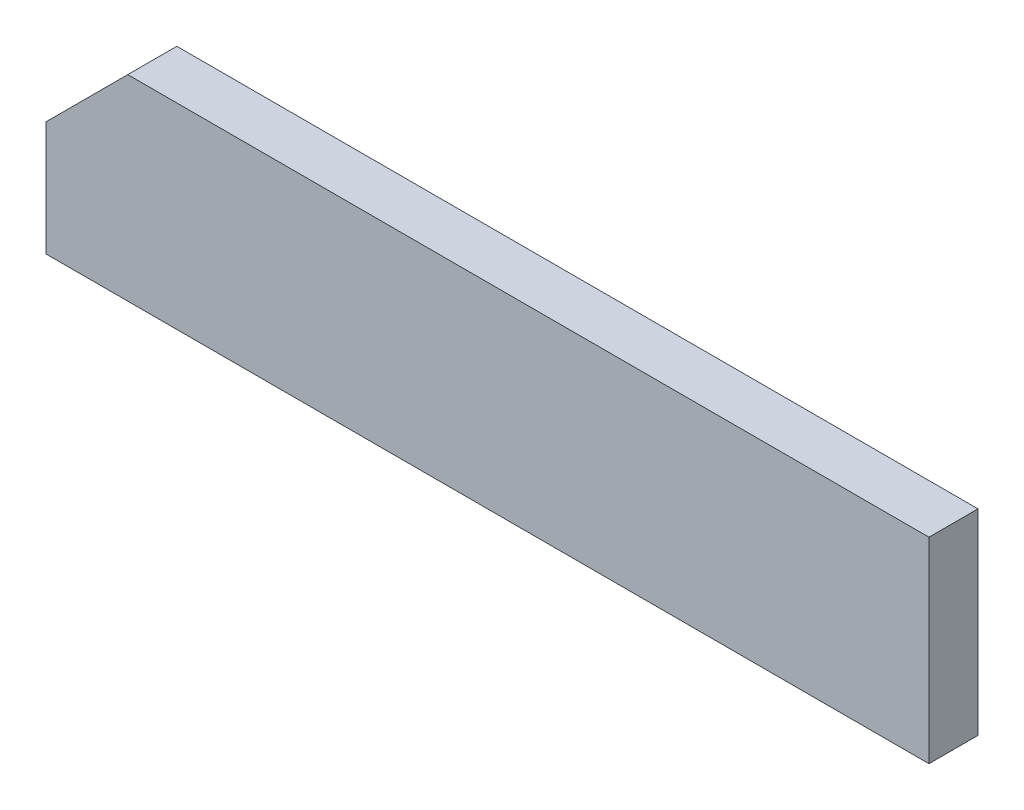
ISO-10303-21;
HEADER;
FILE_DESCRIPTION(('STEP AP214'),'2;1');
FILE_NAME('part.step','',(''),(''),'','','');
FILE_SCHEMA(('AUTOMOTIVE_DESIGN { 1 0 10303 214 1 1 1 1 }'));
ENDSEC;
DATA;
#1=APPLICATION_CONTEXT('core data for automotive mechanical design processes');
#2=APPLICATION_PROTOCOL_DEFINITION('international standard','automotive_design',2000,#1);
#3=PRODUCT_CONTEXT('',#1,'mechanical');
#4=PRODUCT('Part','Part','',(#3));
#5=PRODUCT_RELATED_PRODUCT_CATEGORY('part','',(#4));
#6=PRODUCT_DEFINITION_FORMATION('','',#4);
#7=PRODUCT_DEFINITION_CONTEXT('part definition',#1,'design');
#8=PRODUCT_DEFINITION('design','',#6,#7);
#9=PRODUCT_DEFINITION_SHAPE('','',#8);
#10=(LENGTH_UNIT() NAMED_UNIT(*) SI_UNIT(.MILLI.,.METRE.));
#11=(NAMED_UNIT(*) PLANE_ANGLE_UNIT() SI_UNIT($,.RADIAN.));
#12=(NAMED_UNIT(*) SI_UNIT($,.STERADIAN.) SOLID_ANGLE_UNIT());
#13=UNCERTAINTY_MEASURE_WITH_UNIT(LENGTH_MEASURE(1.E-05),#10,'distance_accuracy_value','');
#14=(GEOMETRIC_REPRESENTATION_CONTEXT(3) GLOBAL_UNCERTAINTY_ASSIGNED_CONTEXT((#13)) GLOBAL_UNIT_ASSIGNED_CONTEXT((#10,
#11,#12)) REPRESENTATION_CONTEXT('',''));
#15=CARTESIAN_POINT('',(0.,0.,0.));
#16=DIRECTION('',(0.,0.,1.));
#17=DIRECTION('',(1.,0.,0.));
#18=AXIS2_PLACEMENT_3D('',#15,#16,#17);
#19=CARTESIAN_POINT('',(0.06528164345011,-0.01762491546688,0.2999994));
#20=DIRECTION('',(0.,0.,1.));
#21=DIRECTION('',(1.,0.,0.));
#22=AXIS2_PLACEMENT_3D('',#19,#20,#21);
#23=PLANE('',#22);
#24=DIRECTION('',(-0.707106781186548,-0.707106781186548,0.));
#25=VECTOR('',#24,1.);
#26=CARTESIAN_POINT('',(-2.20000068,0.5999607,0.2999994));
#27=LINE('',#26,#25);
#28=CARTESIAN_POINT('',(-2.20000068,0.5999607,0.2999994));
#29=VERTEX_POINT('',#28);
#30=CARTESIAN_POINT('',(-2.69999968,0.09996169999999,0.2999994));
#31=VERTEX_POINT('',#30);
#32=EDGE_CURVE('E102',#29,#31,#27,.T.);
#33=ORIENTED_EDGE('',*,*,#32,.T.);
#34=DIRECTION('',(0.,-1.,0.));
#35=VECTOR('',#34,1.);
#36=CARTESIAN_POINT('',(-2.69999968,0.09996169999999,0.2999994));
#37=LINE('',#36,#35);
#38=CARTESIAN_POINT('',(-2.69999968,-0.59995816,0.2999994));
#39=VERTEX_POINT('',#38);
#40=EDGE_CURVE('E75',#31,#39,#37,.T.);
#41=ORIENTED_EDGE('',*,*,#40,.T.);
#42=DIRECTION('',(1.,0.,0.));
#43=VECTOR('',#42,1.);
#44=CARTESIAN_POINT('',(-2.69999968,-0.59995816,0.2999994));
#45=LINE('',#44,#43);
#46=CARTESIAN_POINT('',(2.69999968,-0.59995816,0.2999994));
#47=VERTEX_POINT('',#46);
#48=EDGE_CURVE('E113',#39,#47,#45,.T.);
#49=ORIENTED_EDGE('',*,*,#48,.T.);
#50=DIRECTION('',(0.,1.,0.));
#51=VECTOR('',#50,1.);
#52=CARTESIAN_POINT('',(2.69999968,-0.59995816,0.2999994));
#53=LINE('',#52,#51);
#54=CARTESIAN_POINT('',(2.69999968,0.5999607,0.2999994));
#55=VERTEX_POINT('',#54);
#56=EDGE_CURVE('E89',#47,#55,#53,.T.);
#57=ORIENTED_EDGE('',*,*,#56,.T.);
#58=DIRECTION('',(-1.,0.,0.));
#59=VECTOR('',#58,1.);
#60=CARTESIAN_POINT('',(2.69999968,0.5999607,0.2999994));
#61=LINE('',#60,#59);
#62=EDGE_CURVE('E11',#55,#29,#61,.T.);
#63=ORIENTED_EDGE('',*,*,#62,.T.);
#64=EDGE_LOOP('',(#33,#41,#49,#57,#63));
#65=FACE_BOUND('',#64,.T.);
#66=ADVANCED_FACE('F16',(#65),#23,.T.);
#67=CARTESIAN_POINT('',(0.06528164345011,-0.01762491546688,0.));
#68=DIRECTION('',(0.,0.,1.));
#69=DIRECTION('',(1.,0.,0.));
#70=AXIS2_PLACEMENT_3D('',#67,#68,#69);
#71=PLANE('',#70);
#72=DIRECTION('',(-0.707106781186548,-0.707106781186548,0.));
#73=VECTOR('',#72,1.);
#74=CARTESIAN_POINT('',(-2.20000068,0.5999607,0.));
#75=LINE('',#74,#73);
#76=CARTESIAN_POINT('',(-2.20000068,0.5999607,0.));
#77=VERTEX_POINT('',#76);
#78=CARTESIAN_POINT('',(-2.69999968,0.09996169999999,0.));
#79=VERTEX_POINT('',#78);
#80=EDGE_CURVE('E92',#77,#79,#75,.T.);
#81=ORIENTED_EDGE('',*,*,#80,.F.);
#82=DIRECTION('',(-1.,0.,0.));
#83=VECTOR('',#82,1.);
#84=CARTESIAN_POINT('',(2.69999968,0.5999607,0.));
#85=LINE('',#84,#83);
#86=CARTESIAN_POINT('',(2.69999968,0.5999607,0.));
#87=VERTEX_POINT('',#86);
#88=EDGE_CURVE('E27',#87,#77,#85,.T.);
#89=ORIENTED_EDGE('',*,*,#88,.F.);
#90=DIRECTION('',(0.,1.,0.));
#91=VECTOR('',#90,1.);
#92=CARTESIAN_POINT('',(2.69999968,-0.59995816,0.));
#93=LINE('',#92,#91);
#94=CARTESIAN_POINT('',(2.69999968,-0.59995816,0.));
#95=VERTEX_POINT('',#94);
#96=EDGE_CURVE('E121',#95,#87,#93,.T.);
#97=ORIENTED_EDGE('',*,*,#96,.F.);
#98=DIRECTION('',(1.,0.,0.));
#99=VECTOR('',#98,1.);
#100=CARTESIAN_POINT('',(-2.69999968,-0.59995816,0.));
#101=LINE('',#100,#99);
#102=CARTESIAN_POINT('',(-2.69999968,-0.59995816,0.));
#103=VERTEX_POINT('',#102);
#104=EDGE_CURVE('E20',#103,#95,#101,.T.);
#105=ORIENTED_EDGE('',*,*,#104,.F.);
#106=DIRECTION('',(0.,-1.,0.));
#107=VECTOR('',#106,1.);
#108=CARTESIAN_POINT('',(-2.69999968,0.09996169999999,0.));
#109=LINE('',#108,#107);
#110=EDGE_CURVE('E95',#79,#103,#109,.T.);
#111=ORIENTED_EDGE('',*,*,#110,.F.);
#112=EDGE_LOOP('',(#81,#89,#97,#105,#111));
#113=FACE_BOUND('',#112,.T.);
#114=ADVANCED_FACE('F93',(#113),#71,.F.);
#115=CARTESIAN_POINT('',(2.69999968,0.5999607,0.));
#116=DIRECTION('',(0.,-1.,0.));
#117=DIRECTION('',(0.,0.,-1.));
#118=AXIS2_PLACEMENT_3D('',#115,#116,#117);
#119=PLANE('',#118);
#120=DIRECTION('',(0.,0.,1.));
#121=VECTOR('',#120,1.);
#122=CARTESIAN_POINT('',(2.69999968,0.5999607,0.));
#123=LINE('',#122,#121);
#124=EDGE_CURVE('E86',#87,#55,#123,.T.);
#125=ORIENTED_EDGE('',*,*,#124,.F.);
#126=ORIENTED_EDGE('',*,*,#88,.T.);
#127=DIRECTION('',(0.,0.,1.));
#128=VECTOR('',#127,1.);
#129=CARTESIAN_POINT('',(-2.20000068,0.5999607,0.));
#130=LINE('',#129,#128);
#131=EDGE_CURVE('E84',#77,#29,#130,.T.);
#132=ORIENTED_EDGE('',*,*,#131,.T.);
#133=ORIENTED_EDGE('',*,*,#62,.F.);
#134=EDGE_LOOP('',(#125,#126,#132,#133));
#135=FACE_BOUND('',#134,.T.);
#136=ADVANCED_FACE('F18',(#135),#119,.F.);
#137=CARTESIAN_POINT('',(2.69999968,-0.59995816,0.));
#138=DIRECTION('',(-1.,0.,0.));
#139=DIRECTION('',(0.,0.,1.));
#140=AXIS2_PLACEMENT_3D('',#137,#138,#139);
#141=PLANE('',#140);
#142=DIRECTION('',(0.,0.,1.));
#143=VECTOR('',#142,1.);
#144=CARTESIAN_POINT('',(2.69999968,-0.59995816,0.));
#145=LINE('',#144,#143);
#146=EDGE_CURVE('E110',#95,#47,#145,.T.);
#147=ORIENTED_EDGE('',*,*,#146,.F.);
#148=ORIENTED_EDGE('',*,*,#96,.T.);
#149=ORIENTED_EDGE('',*,*,#124,.T.);
#150=ORIENTED_EDGE('',*,*,#56,.F.);
#151=EDGE_LOOP('',(#147,#148,#149,#150));
#152=FACE_BOUND('',#151,.T.);
#153=ADVANCED_FACE('F151',(#152),#141,.F.);
#154=CARTESIAN_POINT('',(-2.69999968,-0.59995816,0.));
#155=DIRECTION('',(0.,1.,0.));
#156=DIRECTION('',(1.,0.,0.));
#157=AXIS2_PLACEMENT_3D('',#154,#155,#156);
#158=PLANE('',#157);
#159=DIRECTION('',(0.,0.,1.));
#160=VECTOR('',#159,1.);
#161=CARTESIAN_POINT('',(-2.69999968,-0.59995816,0.));
#162=LINE('',#161,#160);
#163=EDGE_CURVE('E126',#103,#39,#162,.T.);
#164=ORIENTED_EDGE('',*,*,#163,.F.);
#165=ORIENTED_EDGE('',*,*,#104,.T.);
#166=ORIENTED_EDGE('',*,*,#146,.T.);
#167=ORIENTED_EDGE('',*,*,#48,.F.);
#168=EDGE_LOOP('',(#164,#165,#166,#167));
#169=FACE_BOUND('',#168,.T.);
#170=ADVANCED_FACE('F146',(#169),#158,.F.);
#171=CARTESIAN_POINT('',(-2.69999968,0.09996169999999,0.));
#172=DIRECTION('',(1.,0.,0.));
#173=DIRECTION('',(0.,1.,0.));
#174=AXIS2_PLACEMENT_3D('',#171,#172,#173);
#175=PLANE('',#174);
#176=DIRECTION('',(0.,0.,1.));
#177=VECTOR('',#176,1.);
#178=CARTESIAN_POINT('',(-2.69999968,0.09996169999999,0.));
#179=LINE('',#178,#177);
#180=EDGE_CURVE('E99',#79,#31,#179,.T.);
#181=ORIENTED_EDGE('',*,*,#180,.F.);
#182=ORIENTED_EDGE('',*,*,#110,.T.);
#183=ORIENTED_EDGE('',*,*,#163,.T.);
#184=ORIENTED_EDGE('',*,*,#40,.F.);
#185=EDGE_LOOP('',(#181,#182,#183,#184));
#186=FACE_BOUND('',#185,.T.);
#187=ADVANCED_FACE('F145',(#186),#175,.F.);
#188=CARTESIAN_POINT('',(-2.20000068,0.5999607,0.));
#189=DIRECTION('',(0.707106781186548,-0.707106781186548,0.));
#190=DIRECTION('',(0.,0.,-1.));
#191=AXIS2_PLACEMENT_3D('',#188,#189,#190);
#192=PLANE('',#191);
#193=ORIENTED_EDGE('',*,*,#131,.F.);
#194=ORIENTED_EDGE('',*,*,#80,.T.);
#195=ORIENTED_EDGE('',*,*,#180,.T.);
#196=ORIENTED_EDGE('',*,*,#32,.F.);
#197=EDGE_LOOP('',(#193,#194,#195,#196));
#198=FACE_BOUND('',#197,.T.);
#199=ADVANCED_FACE('F101',(#198),#192,.F.);
#200=CLOSED_SHELL('',(#66,#114,#136,#153,#170,#187,#199));
#201=MANIFOLD_SOLID_BREP('B1',#200);
#202=ADVANCED_BREP_SHAPE_REPRESENTATION('',(#18,#201),#14);
#203=SHAPE_DEFINITION_REPRESENTATION(#9,#202);
ENDSEC;
END-ISO-10303-21;
